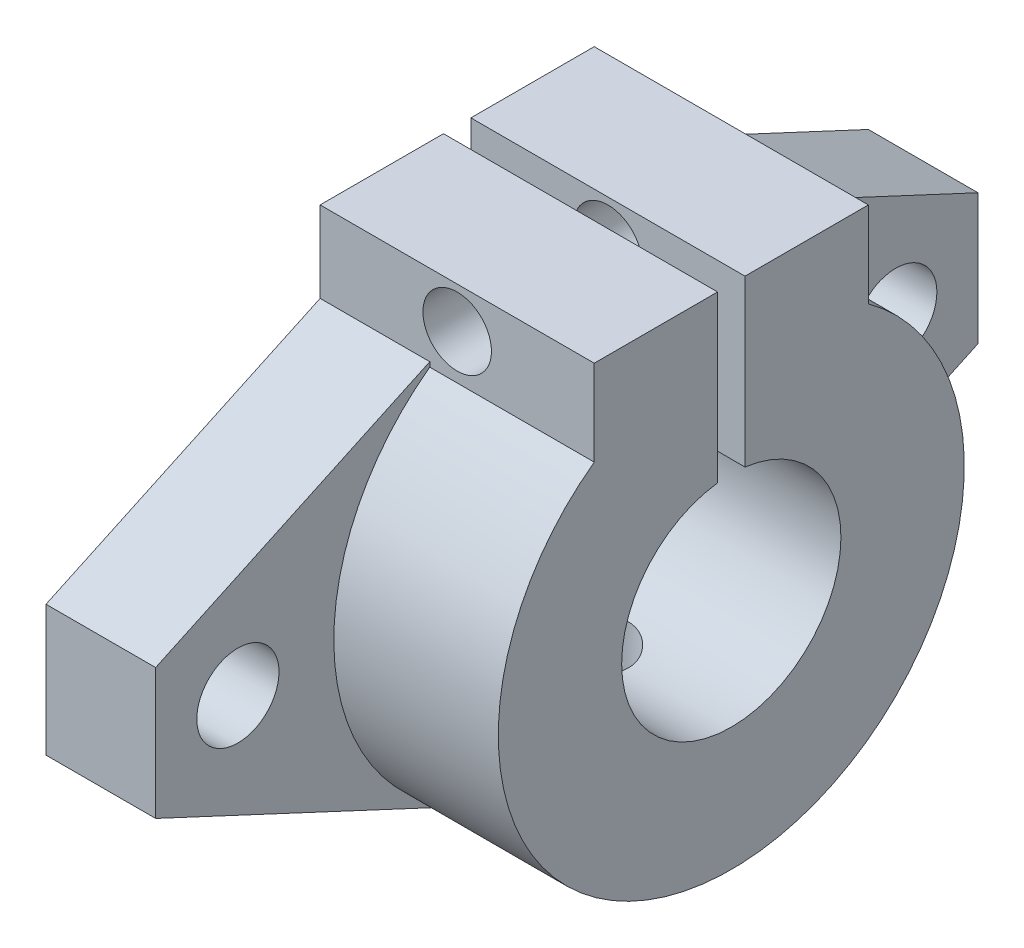
ISO-10303-21;
HEADER;
FILE_DESCRIPTION(('STEP AP214'),'2;1');
FILE_NAME('part.step','',(''),(''),'','','');
FILE_SCHEMA(('AUTOMOTIVE_DESIGN { 1 0 10303 214 1 1 1 1 }'));
ENDSEC;
DATA;
#1=APPLICATION_CONTEXT('core data for automotive mechanical design processes');
#2=APPLICATION_PROTOCOL_DEFINITION('international standard','automotive_design',2000,#1);
#3=PRODUCT_CONTEXT('',#1,'mechanical');
#4=PRODUCT('Part','Part','',(#3));
#5=PRODUCT_RELATED_PRODUCT_CATEGORY('part','',(#4));
#6=PRODUCT_DEFINITION_FORMATION('','',#4);
#7=PRODUCT_DEFINITION_CONTEXT('part definition',#1,'design');
#8=PRODUCT_DEFINITION('design','',#6,#7);
#9=PRODUCT_DEFINITION_SHAPE('','',#8);
#10=(LENGTH_UNIT() NAMED_UNIT(*) SI_UNIT(.MILLI.,.METRE.));
#11=(NAMED_UNIT(*) PLANE_ANGLE_UNIT() SI_UNIT($,.RADIAN.));
#12=(NAMED_UNIT(*) SI_UNIT($,.STERADIAN.) SOLID_ANGLE_UNIT());
#13=UNCERTAINTY_MEASURE_WITH_UNIT(LENGTH_MEASURE(1.E-05),#10,'distance_accuracy_value','');
#14=(GEOMETRIC_REPRESENTATION_CONTEXT(3) GLOBAL_UNCERTAINTY_ASSIGNED_CONTEXT((#13)) GLOBAL_UNIT_ASSIGNED_CONTEXT((#10,
#11,#12)) REPRESENTATION_CONTEXT('',''));
#15=CARTESIAN_POINT('',(0.,0.,0.));
#16=DIRECTION('',(0.,0.,1.));
#17=DIRECTION('',(1.,0.,0.));
#18=AXIS2_PLACEMENT_3D('',#15,#16,#17);
#19=CARTESIAN_POINT('',(0.,20.,0.));
#20=DIRECTION('',(0.,-1.,0.));
#21=DIRECTION('',(0.,0.,-1.));
#22=AXIS2_PLACEMENT_3D('',#19,#20,#21);
#23=PLANE('',#22);
#24=DIRECTION('',(0.,0.,-1.));
#25=VECTOR('',#24,1.);
#26=CARTESIAN_POINT('',(20.,20.,10.));
#27=LINE('',#26,#25);
#28=CARTESIAN_POINT('',(20.,20.,10.));
#29=VERTEX_POINT('',#28);
#30=CARTESIAN_POINT('',(20.,20.,1.));
#31=VERTEX_POINT('',#30);
#32=EDGE_CURVE('E306',#29,#31,#27,.T.);
#33=ORIENTED_EDGE('',*,*,#32,.T.);
#34=DIRECTION('',(1.,0.,0.));
#35=VECTOR('',#34,1.);
#36=CARTESIAN_POINT('',(0.,20.,1.));
#37=LINE('',#36,#35);
#38=CARTESIAN_POINT('',(0.,20.,1.));
#39=VERTEX_POINT('',#38);
#40=EDGE_CURVE('E160',#39,#31,#37,.T.);
#41=ORIENTED_EDGE('',*,*,#40,.F.);
#42=DIRECTION('',(0.,0.,-1.));
#43=VECTOR('',#42,1.);
#44=CARTESIAN_POINT('',(0.,20.,10.));
#45=LINE('',#44,#43);
#46=CARTESIAN_POINT('',(0.,20.,10.));
#47=VERTEX_POINT('',#46);
#48=EDGE_CURVE('E178',#47,#39,#45,.T.);
#49=ORIENTED_EDGE('',*,*,#48,.F.);
#50=DIRECTION('',(1.,0.,0.));
#51=VECTOR('',#50,1.);
#52=CARTESIAN_POINT('',(0.,20.,10.));
#53=LINE('',#52,#51);
#54=EDGE_CURVE('E185',#47,#29,#53,.T.);
#55=ORIENTED_EDGE('',*,*,#54,.T.);
#56=EDGE_LOOP('',(#33,#41,#49,#55));
#57=FACE_BOUND('',#56,.T.);
#58=ADVANCED_FACE('F36',(#57),#23,.F.);
#59=CARTESIAN_POINT('',(20.,0.,0.));
#60=DIRECTION('',(-1.,0.,0.));
#61=DIRECTION('',(0.,0.,1.));
#62=AXIS2_PLACEMENT_3D('',#59,#60,#61);
#63=CYLINDRICAL_SURFACE('',#62,17.);
#64=CARTESIAN_POINT('',(7.5,-17.,0.));
#65=CARTESIAN_POINT('',(7.5000057818919,-16.999997793131,0.139618263933644));
#66=CARTESIAN_POINT('',(7.51173543487887,-16.9982619631343,0.279318334742722));
#67=CARTESIAN_POINT('',(7.55833351140894,-16.9915044414465,0.554815864347194));
#68=CARTESIAN_POINT('',(7.5932246719528,-16.9864795210156,0.690609351356019));
#69=CARTESIAN_POINT('',(7.68508252661281,-16.9737086836159,0.954266664820791));
#70=CARTESIAN_POINT('',(7.74203276548722,-16.9659647952965,1.08213631987448));
#71=CARTESIAN_POINT('',(7.87635246620653,-16.9486124241397,1.3264840365203));
#72=CARTESIAN_POINT('',(7.95371900828681,-16.9390042079744,1.44296372374599));
#73=CARTESIAN_POINT('',(8.12729534764653,-16.9189113868221,1.66212119979329));
#74=CARTESIAN_POINT('',(8.22362834272149,-16.9084213236713,1.76470092382526));
#75=CARTESIAN_POINT('',(8.43213798364859,-16.887789985922,1.95230070871523));
#76=CARTESIAN_POINT('',(8.54431552629467,-16.8776487311065,2.03731977497712));
#77=CARTESIAN_POINT('',(8.78198626363384,-16.8588102121396,2.18776463859896));
#78=CARTESIAN_POINT('',(8.90753989572348,-16.8501200004422,2.25309591742832));
#79=CARTESIAN_POINT('',(9.16798702676943,-16.8352417558288,2.36170671911329));
#80=CARTESIAN_POINT('',(9.30288003618359,-16.8290535918791,2.40498739680279));
#81=CARTESIAN_POINT('',(9.57714699371305,-16.819933589302,2.46796464304165));
#82=CARTESIAN_POINT('',(9.71648166832152,-16.8169786171038,2.4878288374678));
#83=CARTESIAN_POINT('',(9.99653561388198,-16.8145892786749,2.50392846030982));
#84=CARTESIAN_POINT('',(10.1372548079492,-16.8151547180392,2.50016519348747));
#85=CARTESIAN_POINT('',(10.4149011948491,-16.8197211578168,2.46925378270774));
#86=CARTESIAN_POINT('',(10.5518496591263,-16.8236947679923,2.44229207080977));
#87=CARTESIAN_POINT('',(10.8192574442999,-16.8345870467401,2.36604083270518));
#88=CARTESIAN_POINT('',(10.949716588053,-16.8415057956586,2.31675069735604));
#89=CARTESIAN_POINT('',(11.2010112183851,-16.857539142223,2.19704705914093));
#90=CARTESIAN_POINT('',(11.321808420458,-16.8666619500121,2.12655433007144));
#91=CARTESIAN_POINT('',(11.5499300408962,-16.8860695216999,1.96650298810832));
#92=CARTESIAN_POINT('',(11.6572536081856,-16.8963543589216,1.87694317178514));
#93=CARTESIAN_POINT('',(11.8564621362888,-16.9170482652418,1.6802753243751));
#94=CARTESIAN_POINT('',(11.9481888499099,-16.9274575785055,1.57300695254414));
#95=CARTESIAN_POINT('',(12.112361690249,-16.9471357134677,1.34451413749425));
#96=CARTESIAN_POINT('',(12.1848077383585,-16.9564045305161,1.22328963737823));
#97=CARTESIAN_POINT('',(12.3083698864632,-16.9727664753804,0.9701904368467));
#98=CARTESIAN_POINT('',(12.3594740689283,-16.9798583870044,0.838309834869856));
#99=CARTESIAN_POINT('',(12.4387657716015,-16.991057196357,0.567710944898676));
#100=CARTESIAN_POINT('',(12.4669547803696,-16.9951642879764,0.428993101669628));
#101=CARTESIAN_POINT('',(12.4994062031872,-16.9999050818336,0.15002351928223));
#102=CARTESIAN_POINT('',(12.5038862295277,-17.0005703732726,0.00979761097236577));
#103=CARTESIAN_POINT('',(12.4893697048661,-16.9984385067869,-0.269403415413675));
#104=CARTESIAN_POINT('',(12.4703738516153,-16.9956414517703,-0.408378570541142));
#105=CARTESIAN_POINT('',(12.4096257278691,-16.9869187192332,-0.680476104424863));
#106=CARTESIAN_POINT('',(12.3679791908908,-16.9810075822558,-0.813622595189719));
#107=CARTESIAN_POINT('',(12.2632231929786,-16.9667174597167,-1.07104301967474));
#108=CARTESIAN_POINT('',(12.2001127581768,-16.9583383621802,-1.19531655049811));
#109=CARTESIAN_POINT('',(12.05370788706,-16.9399652839742,-1.43242218615397));
#110=CARTESIAN_POINT('',(11.9702750642557,-16.9299603948874,-1.54516798121673));
#111=CARTESIAN_POINT('',(11.7857868287116,-16.9094840590999,-1.75513489222198));
#112=CARTESIAN_POINT('',(11.6847304336169,-16.8990125864157,-1.85235514217674));
#113=CARTESIAN_POINT('',(11.4668961579167,-16.8786834541762,-2.02930056628108));
#114=CARTESIAN_POINT('',(11.3499993493592,-16.8688313544641,-2.10888006584901));
#115=CARTESIAN_POINT('',(11.1043698926707,-16.8509540599789,-2.24727323997786));
#116=CARTESIAN_POINT('',(10.9756375545786,-16.8429288173692,-2.3060874583028));
#117=CARTESIAN_POINT('',(10.7104301688104,-16.8296538581595,-2.40105348668989));
#118=CARTESIAN_POINT('',(10.5739833136259,-16.8243946779348,-2.43728264767767));
#119=CARTESIAN_POINT('',(10.2968588468238,-16.8172219020188,-2.48629673443479));
#120=CARTESIAN_POINT('',(10.1561815156867,-16.815308085025,-2.49908321098619));
#121=CARTESIAN_POINT('',(9.87604101010156,-16.8150507670265,-2.50081314025998));
#122=CARTESIAN_POINT('',(9.7365792272196,-16.8166729719777,-2.48998561242761));
#123=CARTESIAN_POINT('',(9.46148268732387,-16.8232304869987,-2.4452849279886));
#124=CARTESIAN_POINT('',(9.32584792511209,-16.8281657925681,-2.41141180268506));
#125=CARTESIAN_POINT('',(9.06231488044494,-16.8407816094163,-2.32166128628094));
#126=CARTESIAN_POINT('',(8.93441126071403,-16.8484602009356,-2.26579928028701));
#127=CARTESIAN_POINT('',(8.68975477312122,-16.8656998369544,-2.13367943489691));
#128=CARTESIAN_POINT('',(8.57300225333166,-16.8752609401864,-2.05742095912403));
#129=CARTESIAN_POINT('',(8.35279758221689,-16.8952988011725,-1.88583847980749));
#130=CARTESIAN_POINT('',(8.24947840565394,-16.9057832085905,-1.79034469442663));
#131=CARTESIAN_POINT('',(8.06024921946042,-16.92642201351,-1.58336095356046));
#132=CARTESIAN_POINT('',(7.97434326811475,-16.9365763336202,-1.47186727949618));
#133=CARTESIAN_POINT('',(7.82197580820316,-16.9554718925697,-1.23535773881122));
#134=CARTESIAN_POINT('',(7.75561935846873,-16.9642053874589,-1.11027358494527));
#135=CARTESIAN_POINT('',(7.64495569968175,-16.9791991247469,-0.850667584310129));
#136=CARTESIAN_POINT('',(7.60062551088327,-16.9854619433621,-0.716155741284794));
#137=CARTESIAN_POINT('',(7.54540047060192,-16.9933688461727,-0.484190218187674));
#138=CARTESIAN_POINT('',(7.52840111324459,-16.9958428419025,-0.38817262422865));
#139=CARTESIAN_POINT('',(7.5056989270881,-16.9991591791261,-0.194783283695076));
#140=CARTESIAN_POINT('',(7.49999596597856,-17.0000015397308,-0.0974115529944622));
#141=CARTESIAN_POINT('',(7.5,-17.,0.));
#142=B_SPLINE_CURVE_WITH_KNOTS('',3,(#64,#65,#66,#67,#68,#69,#70,#71,#72,#73,#74,#75,#76,#77,
#78,#79,#80,#81,#82,#83,#84,#85,#86,#87,#88,#89,#90,#91,#92,#93,#94,#95,#96,#97,#98,#99,#100,
#101,#102,#103,#104,#105,#106,#107,#108,#109,#110,#111,#112,#113,#114,#115,#116,#117,#118,#119,
#120,#121,#122,#123,#124,#125,#126,#127,#128,#129,#130,#131,#132,#133,#134,#135,#136,#137,#138,
#139,#140,#141),.UNSPECIFIED.,.T.,.F.,(4,2,2,2,2,2,2,2,2,2,2,2,2,2,2,2,2,2,2,2,2,2,2,2,2,2,2,2,
2,2,2,2,2,2,2,2,2,2,4),(0.,0.418498857511903,0.83740915233018,1.25600755579684,1.67454612732146,
2.09589880308585,2.51727533677714,2.94064374704006,3.36398998237661,3.78428694551126,
4.20456069910212,4.62148817747431,5.03842703074502,5.45694360373011,5.87548659945092,
6.29805109091574,6.72061730517519,7.14341917050654,7.56619356861207,7.98508072630458,
8.40395543411031,8.82089140788565,9.23784630155638,9.65772400348285,10.0776251172785,
10.5008742387869,10.9241122761825,11.3458926970847,11.7676452153327,12.1853255880243,
12.6030053933771,13.0203934758991,13.4377945825891,13.8590554809119,14.2804144447029,
14.7039981269519,15.1271389563846,15.4191287002785,15.7111150241882),.UNSPECIFIED.);
#143=CARTESIAN_POINT('',(7.5,-17.,0.));
#144=VERTEX_POINT('',#143);
#145=EDGE_CURVE('E286',#144,#144,#142,.T.);
#146=ORIENTED_EDGE('',*,*,#145,.T.);
#147=EDGE_LOOP('',(#146));
#148=FACE_BOUND('',#147,.T.);
#149=DIRECTION('',(-1.,0.,0.));
#150=VECTOR('',#149,1.);
#151=CARTESIAN_POINT('',(20.,13.7477270848675,-10.));
#152=LINE('',#151,#150);
#153=CARTESIAN_POINT('',(8.,13.7477270848675,-10.));
#154=VERTEX_POINT('',#153);
#155=CARTESIAN_POINT('',(20.,13.7477270848675,-10.));
#156=VERTEX_POINT('',#155);
#157=EDGE_CURVE('E201',#154,#156,#152,.F.);
#158=ORIENTED_EDGE('',*,*,#157,.T.);
#159=CARTESIAN_POINT('',(20.,0.,0.));
#160=DIRECTION('',(1.,0.,0.));
#161=DIRECTION('',(0.,0.,-1.));
#162=AXIS2_PLACEMENT_3D('',#159,#160,#161);
#163=CIRCLE('',#162,17.);
#164=CARTESIAN_POINT('',(20.,13.7477270848763,10.));
#165=VERTEX_POINT('',#164);
#166=EDGE_CURVE('E245',#165,#156,#163,.T.);
#167=ORIENTED_EDGE('',*,*,#166,.F.);
#168=DIRECTION('',(-1.,0.,0.));
#169=VECTOR('',#168,1.);
#170=CARTESIAN_POINT('',(20.,13.7477270848675,10.));
#171=LINE('',#170,#169);
#172=CARTESIAN_POINT('',(8.,13.7477270848675,10.));
#173=VERTEX_POINT('',#172);
#174=EDGE_CURVE('E196',#173,#165,#171,.F.);
#175=ORIENTED_EDGE('',*,*,#174,.F.);
#176=CARTESIAN_POINT('',(8.,0.,0.));
#177=DIRECTION('',(1.,0.,0.));
#178=DIRECTION('',(0.,0.,-1.));
#179=AXIS2_PLACEMENT_3D('',#176,#177,#178);
#180=CIRCLE('',#179,17.);
#181=CARTESIAN_POINT('',(8.,-15.4072323796231,7.18451044959185));
#182=VERTEX_POINT('',#181);
#183=EDGE_CURVE('E255',#173,#182,#180,.T.);
#184=ORIENTED_EDGE('',*,*,#183,.T.);
#185=DIRECTION('',(-1.,0.,0.));
#186=VECTOR('',#185,1.);
#187=CARTESIAN_POINT('',(8.,-15.4072323796231,7.18451044959185));
#188=LINE('',#187,#186);
#189=CARTESIAN_POINT('',(0.,-15.4072323796231,7.18451044959185));
#190=VERTEX_POINT('',#189);
#191=EDGE_CURVE('E265',#182,#190,#188,.T.);
#192=ORIENTED_EDGE('',*,*,#191,.T.);
#193=CARTESIAN_POINT('',(0.,0.,0.));
#194=DIRECTION('',(1.,0.,0.));
#195=DIRECTION('',(0.,0.,-1.));
#196=AXIS2_PLACEMENT_3D('',#193,#194,#195);
#197=CIRCLE('',#196,17.);
#198=CARTESIAN_POINT('',(0.,-15.4072323796231,-7.18451044959186));
#199=VERTEX_POINT('',#198);
#200=EDGE_CURVE('E246',#190,#199,#197,.T.);
#201=ORIENTED_EDGE('',*,*,#200,.T.);
#202=DIRECTION('',(-1.,0.,0.));
#203=VECTOR('',#202,1.);
#204=CARTESIAN_POINT('',(8.,-15.4072323796231,-7.18451044959186));
#205=LINE('',#204,#203);
#206=CARTESIAN_POINT('',(8.,-15.4072323796231,-7.18451044959186));
#207=VERTEX_POINT('',#206);
#208=EDGE_CURVE('E239',#207,#199,#205,.T.);
#209=ORIENTED_EDGE('',*,*,#208,.F.);
#210=CARTESIAN_POINT('',(8.,0.,0.));
#211=DIRECTION('',(1.,0.,0.));
#212=DIRECTION('',(0.,0.,-1.));
#213=AXIS2_PLACEMENT_3D('',#210,#211,#212);
#214=CIRCLE('',#213,17.);
#215=EDGE_CURVE('E211',#207,#154,#214,.T.);
#216=ORIENTED_EDGE('',*,*,#215,.T.);
#217=EDGE_LOOP('',(#158,#167,#175,#184,#192,#201,#209,#216));
#218=FACE_BOUND('',#217,.T.);
#219=ADVANCED_FACE('F334',(#148,#218),#63,.T.);
#220=CARTESIAN_POINT('',(8.,15.4072323796231,-7.18451044959185));
#221=DIRECTION('',(0.,0.906307787036651,-0.422618261740697));
#222=DIRECTION('',(0.,0.422618261740697,0.906307787036651));
#223=AXIS2_PLACEMENT_3D('',#220,#221,#222);
#224=PLANE('',#223);
#225=DIRECTION('',(0.,-0.422618261740697,-0.906307787036651));
#226=VECTOR('',#225,1.);
#227=CARTESIAN_POINT('',(0.,15.4072323796231,-7.18451044959185));
#228=LINE('',#227,#226);
#229=CARTESIAN_POINT('',(0.,14.0943480407714,-10.));
#230=VERTEX_POINT('',#229);
#231=CARTESIAN_POINT('',(0.,4.76819487771248,-30.));
#232=VERTEX_POINT('',#231);
#233=EDGE_CURVE('E231',#230,#232,#228,.T.);
#234=ORIENTED_EDGE('',*,*,#233,.F.);
#235=DIRECTION('',(-1.,0.,0.));
#236=VECTOR('',#235,1.);
#237=CARTESIAN_POINT('',(0.,14.0943480407714,-10.));
#238=LINE('',#237,#236);
#239=CARTESIAN_POINT('',(8.,14.0943480408214,-9.99999999999759));
#240=VERTEX_POINT('',#239);
#241=EDGE_CURVE('E207',#240,#230,#238,.T.);
#242=ORIENTED_EDGE('',*,*,#241,.F.);
#243=DIRECTION('',(0.,-0.422618261740697,-0.906307787036651));
#244=VECTOR('',#243,1.);
#245=CARTESIAN_POINT('',(8.,15.4072323796231,-7.18451044959185));
#246=LINE('',#245,#244);
#247=CARTESIAN_POINT('',(8.,4.76819487771248,-30.));
#248=VERTEX_POINT('',#247);
#249=EDGE_CURVE('E220',#240,#248,#246,.T.);
#250=ORIENTED_EDGE('',*,*,#249,.T.);
#251=DIRECTION('',(-1.,0.,0.));
#252=VECTOR('',#251,1.);
#253=CARTESIAN_POINT('',(8.,4.76819487771248,-30.));
#254=LINE('',#253,#252);
#255=EDGE_CURVE('E225',#248,#232,#254,.T.);
#256=ORIENTED_EDGE('',*,*,#255,.T.);
#257=EDGE_LOOP('',(#234,#242,#250,#256));
#258=FACE_BOUND('',#257,.T.);
#259=ADVANCED_FACE('F320',(#258),#224,.T.);
#260=CARTESIAN_POINT('',(8.,0.,0.));
#261=DIRECTION('',(1.,0.,0.));
#262=DIRECTION('',(0.,0.,-1.));
#263=AXIS2_PLACEMENT_3D('',#260,#261,#262);
#264=PLANE('',#263);
#265=CARTESIAN_POINT('',(8.,0.,-24.));
#266=DIRECTION('',(1.,0.,0.));
#267=DIRECTION('',(0.,0.,-1.));
#268=AXIS2_PLACEMENT_3D('',#265,#266,#267);
#269=CIRCLE('',#268,3.);
#270=CARTESIAN_POINT('',(8.,0.,-27.));
#271=VERTEX_POINT('',#270);
#272=EDGE_CURVE('E222',#271,#271,#269,.F.);
#273=ORIENTED_EDGE('',*,*,#272,.T.);
#274=EDGE_LOOP('',(#273));
#275=FACE_BOUND('',#274,.T.);
#276=ORIENTED_EDGE('',*,*,#249,.F.);
#277=DIRECTION('',(0.,1.,0.));
#278=VECTOR('',#277,1.);
#279=CARTESIAN_POINT('',(8.,-500000.,-10.));
#280=LINE('',#279,#278);
#281=EDGE_CURVE('E205',#154,#240,#280,.T.);
#282=ORIENTED_EDGE('',*,*,#281,.F.);
#283=ORIENTED_EDGE('',*,*,#215,.F.);
#284=DIRECTION('',(0.,0.422618261740697,-0.906307787036651));
#285=VECTOR('',#284,1.);
#286=CARTESIAN_POINT('',(8.,-15.4072323796231,-7.18451044959185));
#287=LINE('',#286,#285);
#288=CARTESIAN_POINT('',(8.,-4.76819487771248,-30.));
#289=VERTEX_POINT('',#288);
#290=EDGE_CURVE('E214',#207,#289,#287,.T.);
#291=ORIENTED_EDGE('',*,*,#290,.T.);
#292=DIRECTION('',(0.,-1.,0.));
#293=VECTOR('',#292,1.);
#294=CARTESIAN_POINT('',(8.,0.,-30.));
#295=LINE('',#294,#293);
#296=EDGE_CURVE('E217',#248,#289,#295,.T.);
#297=ORIENTED_EDGE('',*,*,#296,.F.);
#298=EDGE_LOOP('',(#276,#282,#283,#291,#297));
#299=FACE_BOUND('',#298,.T.);
#300=ADVANCED_FACE('F429',(#275,#299),#264,.T.);
#301=CARTESIAN_POINT('',(8.,15.4072323796231,7.18451044959185));
#302=DIRECTION('',(0.,-0.906307787036651,-0.422618261740697));
#303=DIRECTION('',(0.,0.422618261740697,-0.906307787036651));
#304=AXIS2_PLACEMENT_3D('',#301,#302,#303);
#305=PLANE('',#304);
#306=DIRECTION('',(0.,-0.422618261740697,0.906307787036651));
#307=VECTOR('',#306,1.);
#308=CARTESIAN_POINT('',(8.,15.4072323796231,7.18451044959185));
#309=LINE('',#308,#307);
#310=CARTESIAN_POINT('',(8.,14.0943480408214,9.99999999999759));
#311=VERTEX_POINT('',#310);
#312=CARTESIAN_POINT('',(8.,4.76819487771247,30.));
#313=VERTEX_POINT('',#312);
#314=EDGE_CURVE('E258',#311,#313,#309,.T.);
#315=ORIENTED_EDGE('',*,*,#314,.F.);
#316=DIRECTION('',(1.,0.,0.));
#317=VECTOR('',#316,1.);
#318=CARTESIAN_POINT('',(0.,14.0943480407714,10.));
#319=LINE('',#318,#317);
#320=CARTESIAN_POINT('',(0.,14.0943480408282,10.));
#321=VERTEX_POINT('',#320);
#322=EDGE_CURVE('E203',#321,#311,#319,.T.);
#323=ORIENTED_EDGE('',*,*,#322,.F.);
#324=DIRECTION('',(0.,-0.422618261740697,0.906307787036651));
#325=VECTOR('',#324,1.);
#326=CARTESIAN_POINT('',(0.,15.4072323796231,7.18451044959185));
#327=LINE('',#326,#325);
#328=CARTESIAN_POINT('',(0.,4.76819487771247,30.));
#329=VERTEX_POINT('',#328);
#330=EDGE_CURVE('E268',#321,#329,#327,.T.);
#331=ORIENTED_EDGE('',*,*,#330,.T.);
#332=DIRECTION('',(-1.,0.,0.));
#333=VECTOR('',#332,1.);
#334=CARTESIAN_POINT('',(8.,4.76819487771247,30.));
#335=LINE('',#334,#333);
#336=EDGE_CURVE('E11',#313,#329,#335,.T.);
#337=ORIENTED_EDGE('',*,*,#336,.F.);
#338=EDGE_LOOP('',(#315,#323,#331,#337));
#339=FACE_BOUND('',#338,.T.);
#340=ADVANCED_FACE('F351',(#339),#305,.F.);
#341=CARTESIAN_POINT('',(8.,0.,30.));
#342=DIRECTION('',(0.,0.,-1.));
#343=DIRECTION('',(-1.,0.,0.));
#344=AXIS2_PLACEMENT_3D('',#341,#342,#343);
#345=PLANE('',#344);
#346=DIRECTION('',(0.,-1.,0.));
#347=VECTOR('',#346,1.);
#348=CARTESIAN_POINT('',(0.,0.,30.));
#349=LINE('',#348,#347);
#350=CARTESIAN_POINT('',(0.,-4.76819487771247,30.));
#351=VERTEX_POINT('',#350);
#352=EDGE_CURVE('E270',#329,#351,#349,.T.);
#353=ORIENTED_EDGE('',*,*,#352,.T.);
#354=DIRECTION('',(-1.,0.,0.));
#355=VECTOR('',#354,1.);
#356=CARTESIAN_POINT('',(8.,-4.76819487771247,30.));
#357=LINE('',#356,#355);
#358=CARTESIAN_POINT('',(8.,-4.76819487771247,30.));
#359=VERTEX_POINT('',#358);
#360=EDGE_CURVE('E49',#359,#351,#357,.T.);
#361=ORIENTED_EDGE('',*,*,#360,.F.);
#362=DIRECTION('',(0.,-1.,0.));
#363=VECTOR('',#362,1.);
#364=CARTESIAN_POINT('',(8.,0.,30.));
#365=LINE('',#364,#363);
#366=EDGE_CURVE('E260',#313,#359,#365,.T.);
#367=ORIENTED_EDGE('',*,*,#366,.F.);
#368=ORIENTED_EDGE('',*,*,#336,.T.);
#369=EDGE_LOOP('',(#353,#361,#367,#368));
#370=FACE_BOUND('',#369,.T.);
#371=ADVANCED_FACE('F348',(#370),#345,.F.);
#372=CARTESIAN_POINT('',(8.,0.,24.));
#373=DIRECTION('',(-1.,0.,0.));
#374=DIRECTION('',(0.,0.,1.));
#375=AXIS2_PLACEMENT_3D('',#372,#373,#374);
#376=CYLINDRICAL_SURFACE('',#375,3.);
#377=CARTESIAN_POINT('',(8.,0.,24.));
#378=DIRECTION('',(1.,0.,0.));
#379=DIRECTION('',(0.,0.,-1.));
#380=AXIS2_PLACEMENT_3D('',#377,#378,#379);
#381=CIRCLE('',#380,3.);
#382=CARTESIAN_POINT('',(8.,0.,21.));
#383=VERTEX_POINT('',#382);
#384=EDGE_CURVE('E252',#383,#383,#381,.T.);
#385=ORIENTED_EDGE('',*,*,#384,.T.);
#386=EDGE_LOOP('',(#385));
#387=FACE_BOUND('',#386,.T.);
#388=CARTESIAN_POINT('',(0.,0.,24.));
#389=DIRECTION('',(1.,0.,0.));
#390=DIRECTION('',(0.,0.,-1.));
#391=AXIS2_PLACEMENT_3D('',#388,#389,#390);
#392=CIRCLE('',#391,3.);
#393=CARTESIAN_POINT('',(0.,0.,21.));
#394=VERTEX_POINT('',#393);
#395=EDGE_CURVE('E249',#394,#394,#392,.T.);
#396=ORIENTED_EDGE('',*,*,#395,.F.);
#397=EDGE_LOOP('',(#396));
#398=FACE_BOUND('',#397,.T.);
#399=ADVANCED_FACE('F38',(#387,#398),#376,.F.);
#400=CARTESIAN_POINT('',(8.,-15.4072323796231,7.18451044959185));
#401=DIRECTION('',(0.,-0.906307787036651,0.422618261740697));
#402=DIRECTION('',(0.,-0.422618261740697,-0.906307787036651));
#403=AXIS2_PLACEMENT_3D('',#400,#401,#402);
#404=PLANE('',#403);
#405=DIRECTION('',(0.,0.422618261740697,0.906307787036651));
#406=VECTOR('',#405,1.);
#407=CARTESIAN_POINT('',(0.,-15.4072323796231,7.18451044959185));
#408=LINE('',#407,#406);
#409=EDGE_CURVE('E256',#190,#351,#408,.T.);
#410=ORIENTED_EDGE('',*,*,#409,.F.);
#411=ORIENTED_EDGE('',*,*,#191,.F.);
#412=DIRECTION('',(0.,0.422618261740697,0.906307787036651));
#413=VECTOR('',#412,1.);
#414=CARTESIAN_POINT('',(8.,-15.4072323796231,7.18451044959185));
#415=LINE('',#414,#413);
#416=EDGE_CURVE('E262',#182,#359,#415,.T.);
#417=ORIENTED_EDGE('',*,*,#416,.T.);
#418=ORIENTED_EDGE('',*,*,#360,.T.);
#419=EDGE_LOOP('',(#410,#411,#417,#418));
#420=FACE_BOUND('',#419,.T.);
#421=ADVANCED_FACE('F341',(#420),#404,.T.);
#422=CARTESIAN_POINT('',(8.,0.,0.));
#423=DIRECTION('',(1.,0.,0.));
#424=DIRECTION('',(0.,0.,-1.));
#425=AXIS2_PLACEMENT_3D('',#422,#423,#424);
#426=PLANE('',#425);
#427=DIRECTION('',(0.,1.,0.));
#428=VECTOR('',#427,1.);
#429=CARTESIAN_POINT('',(8.,-500000.,10.));
#430=LINE('',#429,#428);
#431=EDGE_CURVE('E197',#173,#311,#430,.T.);
#432=ORIENTED_EDGE('',*,*,#431,.T.);
#433=ORIENTED_EDGE('',*,*,#314,.T.);
#434=ORIENTED_EDGE('',*,*,#366,.T.);
#435=ORIENTED_EDGE('',*,*,#416,.F.);
#436=ORIENTED_EDGE('',*,*,#183,.F.);
#437=EDGE_LOOP('',(#432,#433,#434,#435,#436));
#438=FACE_BOUND('',#437,.T.);
#439=ORIENTED_EDGE('',*,*,#384,.F.);
#440=EDGE_LOOP('',(#439));
#441=FACE_BOUND('',#440,.T.);
#442=ADVANCED_FACE('F357',(#438,#441),#426,.T.);
#443=CARTESIAN_POINT('',(0.,0.,0.));
#444=DIRECTION('',(1.,0.,0.));
#445=DIRECTION('',(0.,0.,-1.));
#446=AXIS2_PLACEMENT_3D('',#443,#444,#445);
#447=PLANE('',#446);
#448=ORIENTED_EDGE('',*,*,#395,.T.);
#449=EDGE_LOOP('',(#448));
#450=FACE_BOUND('',#449,.T.);
#451=ORIENTED_EDGE('',*,*,#48,.T.);
#452=DIRECTION('',(0.,1.,0.));
#453=VECTOR('',#452,1.);
#454=CARTESIAN_POINT('',(0.,0.,1.));
#455=LINE('',#454,#453);
#456=CARTESIAN_POINT('',(0.,7.93725393319377,1.));
#457=VERTEX_POINT('',#456);
#458=EDGE_CURVE('E65',#457,#39,#455,.T.);
#459=ORIENTED_EDGE('',*,*,#458,.F.);
#460=CARTESIAN_POINT('',(0.,0.,0.));
#461=DIRECTION('',(1.,0.,0.));
#462=DIRECTION('',(0.,0.,-1.));
#463=AXIS2_PLACEMENT_3D('',#460,#461,#462);
#464=CIRCLE('',#463,8.);
#465=CARTESIAN_POINT('',(0.,7.93725393319377,-1.));
#466=VERTEX_POINT('',#465);
#467=EDGE_CURVE('E172',#457,#466,#464,.T.);
#468=ORIENTED_EDGE('',*,*,#467,.T.);
#469=DIRECTION('',(0.,1.,0.));
#470=VECTOR('',#469,1.);
#471=CARTESIAN_POINT('',(0.,0.,-1.));
#472=LINE('',#471,#470);
#473=CARTESIAN_POINT('',(0.,20.,-1.));
#474=VERTEX_POINT('',#473);
#475=EDGE_CURVE('E155',#466,#474,#472,.T.);
#476=ORIENTED_EDGE('',*,*,#475,.T.);
#477=CARTESIAN_POINT('',(0.,20.,-10.));
#478=VERTEX_POINT('',#477);
#479=EDGE_CURVE('E169',#474,#478,#45,.T.);
#480=ORIENTED_EDGE('',*,*,#479,.T.);
#481=DIRECTION('',(0.,1.,0.));
#482=VECTOR('',#481,1.);
#483=CARTESIAN_POINT('',(0.,-500000.,-10.));
#484=LINE('',#483,#482);
#485=EDGE_CURVE('E194',#230,#478,#484,.T.);
#486=ORIENTED_EDGE('',*,*,#485,.F.);
#487=ORIENTED_EDGE('',*,*,#233,.T.);
#488=DIRECTION('',(0.,-1.,0.));
#489=VECTOR('',#488,1.);
#490=CARTESIAN_POINT('',(0.,0.,-30.));
#491=LINE('',#490,#489);
#492=CARTESIAN_POINT('',(0.,-4.76819487771248,-30.));
#493=VERTEX_POINT('',#492);
#494=EDGE_CURVE('E228',#232,#493,#491,.T.);
#495=ORIENTED_EDGE('',*,*,#494,.T.);
#496=DIRECTION('',(0.,0.422618261740697,-0.906307787036651));
#497=VECTOR('',#496,1.);
#498=CARTESIAN_POINT('',(0.,-15.4072323796231,-7.18451044959185));
#499=LINE('',#498,#497);
#500=EDGE_CURVE('E200',#199,#493,#499,.T.);
#501=ORIENTED_EDGE('',*,*,#500,.F.);
#502=ORIENTED_EDGE('',*,*,#200,.F.);
#503=ORIENTED_EDGE('',*,*,#409,.T.);
#504=ORIENTED_EDGE('',*,*,#352,.F.);
#505=ORIENTED_EDGE('',*,*,#330,.F.);
#506=DIRECTION('',(0.,1.,0.));
#507=VECTOR('',#506,1.);
#508=CARTESIAN_POINT('',(0.,-500000.,10.));
#509=LINE('',#508,#507);
#510=EDGE_CURVE('E187',#321,#47,#509,.T.);
#511=ORIENTED_EDGE('',*,*,#510,.T.);
#512=EDGE_LOOP('',(#451,#459,#468,#476,#480,#486,#487,#495,#501,#502,#503,#504,#505,#511));
#513=FACE_BOUND('',#512,.T.);
#514=CARTESIAN_POINT('',(0.,0.,-24.));
#515=DIRECTION('',(1.,0.,0.));
#516=DIRECTION('',(0.,0.,-1.));
#517=AXIS2_PLACEMENT_3D('',#514,#515,#516);
#518=CIRCLE('',#517,3.);
#519=CARTESIAN_POINT('',(0.,0.,-27.));
#520=VERTEX_POINT('',#519);
#521=EDGE_CURVE('E215',#520,#520,#518,.F.);
#522=ORIENTED_EDGE('',*,*,#521,.F.);
#523=EDGE_LOOP('',(#522));
#524=FACE_BOUND('',#523,.T.);
#525=ADVANCED_FACE('F166',(#450,#513,#524),#447,.F.);
#526=CARTESIAN_POINT('',(20.,0.,0.));
#527=DIRECTION('',(-1.,0.,0.));
#528=DIRECTION('',(0.,0.,1.));
#529=AXIS2_PLACEMENT_3D('',#526,#527,#528);
#530=CYLINDRICAL_SURFACE('',#529,8.);
#531=CARTESIAN_POINT('',(10.,-7.59934207678533,2.5));
#532=CARTESIAN_POINT('',(10.1366940722187,-7.59934291923872,2.49999907560094));
#533=CARTESIAN_POINT('',(10.2733975374064,-7.60307063010085,2.48875077582989));
#534=CARTESIAN_POINT('',(10.5427883217556,-7.61751277997754,2.44418350802654));
#535=CARTESIAN_POINT('',(10.6754745454643,-7.62822910706272,2.4108585756503));
#536=CARTESIAN_POINT('',(10.932889803864,-7.65531877671919,2.32339576447118));
#537=CARTESIAN_POINT('',(11.0576324662114,-7.67168210388633,2.26929471473354));
#538=CARTESIAN_POINT('',(11.296305391728,-7.70820812437377,2.14193828346314));
#539=CARTESIAN_POINT('',(11.4102337399202,-7.72837148871681,2.06867951811264));
#540=CARTESIAN_POINT('',(11.627957734987,-7.7710025533724,1.90239214124459));
#541=CARTESIAN_POINT('',(11.731327218872,-7.79352246769561,1.8088187994408));
#542=CARTESIAN_POINT('',(11.9211920264184,-7.83788491720671,1.60572409291099));
#543=CARTESIAN_POINT('',(12.0076849938897,-7.85972735745255,1.49620050503713));
#544=CARTESIAN_POINT('',(12.1632221260225,-7.90087106780156,1.26125182498672));
#545=CARTESIAN_POINT('',(12.2318274076629,-7.9201036912556,1.13552311304019));
#546=CARTESIAN_POINT('',(12.3467520997111,-7.95325103666038,0.873608465706807));
#547=CARTESIAN_POINT('',(12.3930767482992,-7.9671670083984,0.737424996974103));
#548=CARTESIAN_POINT('',(12.4607022561941,-7.98774351641724,0.462928713932196));
#549=CARTESIAN_POINT('',(12.4827314995757,-7.99461477968283,0.324811430936432));
#550=CARTESIAN_POINT('',(12.503448692875,-8.00107191752033,0.0466816279690388));
#551=CARTESIAN_POINT('',(12.5021419487176,-8.00065944820141,-0.0933304539461731));
#552=CARTESIAN_POINT('',(12.4767034168281,-7.99274232265063,-0.366148960709464));
#553=CARTESIAN_POINT('',(12.453361232974,-7.98548301944274,-0.499037268628066));
#554=CARTESIAN_POINT('',(12.385810019914,-7.9649896512175,-0.758906126695562));
#555=CARTESIAN_POINT('',(12.3415996298267,-7.95175519654419,-0.885886290962472));
#556=CARTESIAN_POINT('',(12.2330596218504,-7.92046919458913,-1.13215620630948));
#557=CARTESIAN_POINT('',(12.1684903828745,-7.90236067233341,-1.25133281124536));
#558=CARTESIAN_POINT('',(12.0212578005903,-7.86323445907697,-1.47740502230436));
#559=CARTESIAN_POINT('',(11.9385898817223,-7.84221603291309,-1.58429751241882));
#560=CARTESIAN_POINT('',(11.7534527303996,-7.79847341467064,-1.78747539690657));
#561=CARTESIAN_POINT('',(11.6503018623258,-7.77571463969686,-1.88313309818382));
#562=CARTESIAN_POINT('',(11.4292097963429,-7.73181230889308,-2.05597948519529));
#563=CARTESIAN_POINT('',(11.3112668588193,-7.71066894351396,-2.13316599552377));
#564=CARTESIAN_POINT('',(11.0621650623049,-7.6722169326579,-2.26760930038169));
#565=CARTESIAN_POINT('',(10.9308731820181,-7.65495380588194,-2.32463361399527));
#566=CARTESIAN_POINT('',(10.659881016316,-7.62675090557699,-2.41556691891091));
#567=CARTESIAN_POINT('',(10.5201837716112,-7.61580886035023,-2.44948421530003));
#568=CARTESIAN_POINT('',(10.2423600948457,-7.60199126814082,-2.4920297037281));
#569=CARTESIAN_POINT('',(10.1043960075297,-7.59880932787513,-2.50161908707794));
#570=CARTESIAN_POINT('',(9.82882051700972,-7.6000215491985,-2.49793488996242));
#571=CARTESIAN_POINT('',(9.69120906260067,-7.60441454014633,-2.48466484222813));
#572=CARTESIAN_POINT('',(9.42438340669515,-7.61997914967833,-2.43649747026382));
#573=CARTESIAN_POINT('',(9.2950414518516,-7.63095108204022,-2.40223662321101));
#574=CARTESIAN_POINT('',(9.04395641600833,-7.65822574662762,-2.31380747322029));
#575=CARTESIAN_POINT('',(8.92221457815774,-7.67452934824624,-2.25963592342302));
#576=CARTESIAN_POINT('',(8.68592178045638,-7.71121079306468,-2.13115021311757));
#577=CARTESIAN_POINT('',(8.57167716881442,-7.73169206979508,-2.05630294977117));
#578=CARTESIAN_POINT('',(8.3570193072762,-7.77420697945615,-1.8892128173596));
#579=CARTESIAN_POINT('',(8.25660966214933,-7.79624101471394,-1.79696542938156));
#580=CARTESIAN_POINT('',(8.06817926817436,-7.84048375125371,-1.59314589550721));
#581=CARTESIAN_POINT('',(7.98084442772027,-7.86266184571362,-1.48093129957704));
#582=CARTESIAN_POINT('',(7.82621791335749,-7.90378119687353,-1.24290309130279));
#583=CARTESIAN_POINT('',(7.75892532137793,-7.92272260181891,-1.11709010221724));
#584=CARTESIAN_POINT('',(7.64693887505664,-7.95512623857025,-0.856211046663663));
#585=CARTESIAN_POINT('',(7.60208142431264,-7.968627991224,-0.721220368567511));
#586=CARTESIAN_POINT('',(7.53585492282059,-7.98880485297152,-0.445114508112779));
#587=CARTESIAN_POINT('',(7.51447852183301,-7.99548209828555,-0.304001256680713));
#588=CARTESIAN_POINT('',(7.49641799650076,-8.00111606808923,-0.0259698732977977));
#589=CARTESIAN_POINT('',(7.49874309965848,-8.0003825881478,0.110878383893045));
#590=CARTESIAN_POINT('',(7.52562362209739,-7.99201956162097,0.382146443846496));
#591=CARTESIAN_POINT('',(7.5501775919839,-7.98439046465238,0.516566404359137));
#592=CARTESIAN_POINT('',(7.62018801844455,-7.96319141689591,0.777510236961582));
#593=CARTESIAN_POINT('',(7.66537921569074,-7.9496969592041,0.904111836898962));
#594=CARTESIAN_POINT('',(7.77514165441695,-7.918158911759,1.14799685100018));
#595=CARTESIAN_POINT('',(7.83971621994686,-7.90011454182716,1.26527866254896));
#596=CARTESIAN_POINT('',(7.98894551668888,-7.86059793766752,1.49152338993938));
#597=CARTESIAN_POINT('',(8.07420704492795,-7.83903019501924,1.60006921410622));
#598=CARTESIAN_POINT('',(8.26131977888693,-7.79517473094122,1.80164158279864));
#599=CARTESIAN_POINT('',(8.36317594827877,-7.77288679569653,1.89466346700832));
#600=CARTESIAN_POINT('',(8.5846314396822,-7.72923785154876,2.06565731822505));
#601=CARTESIAN_POINT('',(8.70470680623315,-7.70793201726912,2.14302855989422));
#602=CARTESIAN_POINT('',(8.95679624053828,-7.66960250559062,2.27640941497043));
#603=CARTESIAN_POINT('',(9.0888054529005,-7.65257709722773,2.33242766807092));
#604=CARTESIAN_POINT('',(9.34944523462934,-7.62613120880655,2.41742360871585));
#605=CARTESIAN_POINT('',(9.47740509490313,-7.61618630087498,2.44829879675747));
#606=CARTESIAN_POINT('',(9.73690766419298,-7.60279212964797,2.48958491632199));
#607=CARTESIAN_POINT('',(9.868449482403,-7.59934126603196,2.50000088961557));
#608=CARTESIAN_POINT('',(10.,-7.59934207678533,2.5));
#609=B_SPLINE_CURVE_WITH_KNOTS('',3,(#531,#532,#533,#534,#535,#536,#537,#538,#539,#540,#541,
#542,#543,#544,#545,#546,#547,#548,#549,#550,#551,#552,#553,#554,#555,#556,#557,#558,#559,#560,
#561,#562,#563,#564,#565,#566,#567,#568,#569,#570,#571,#572,#573,#574,#575,#576,#577,#578,#579,
#580,#581,#582,#583,#584,#585,#586,#587,#588,#589,#590,#591,#592,#593,#594,#595,#596,#597,#598,
#599,#600,#601,#602,#603,#604,#605,#606,#607,#608),.UNSPECIFIED.,.T.,.F.,(4,2,2,2,2,2,2,2,2,2,2,
2,2,2,2,2,2,2,2,2,2,2,2,2,2,2,2,2,2,2,2,2,2,2,2,2,2,2,4),(0.,0.409596275096981,
0.819303254119471,1.22828728823716,1.6373436098499,2.05914161101677,2.48099845882245,
2.91239643927467,3.34369294835844,3.76167445671067,4.17956092943549,4.58301965939501,
4.98650470380187,5.39492809216818,5.80345485426376,6.22900677874668,6.65460879707552,
7.08496941871144,7.5151752791037,7.92809866580736,8.34095824443043,8.7418794409359,
9.14286604511284,9.55535226624085,9.96794576028625,10.3976387562789,10.8273120663904,
11.2538047858686,11.6801639628603,12.0887760488391,12.4973614938948,12.9008369303438,
13.3043815982817,13.7216138621529,14.1389711554925,14.5701559100827,15.0011660161251,
15.3954470874764,15.7896309838242),.UNSPECIFIED.);
#610=CARTESIAN_POINT('',(10.,-7.59934207678533,2.5));
#611=VERTEX_POINT('',#610);
#612=EDGE_CURVE('E40',#611,#611,#609,.T.);
#613=ORIENTED_EDGE('',*,*,#612,.F.);
#614=EDGE_LOOP('',(#613));
#615=FACE_BOUND('',#614,.T.);
#616=DIRECTION('',(-1.,0.,0.));
#617=VECTOR('',#616,1.);
#618=CARTESIAN_POINT('',(20.,7.93725393319377,1.));
#619=LINE('',#618,#617);
#620=CARTESIAN_POINT('',(20.,7.93725393319377,1.));
#621=VERTEX_POINT('',#620);
#622=EDGE_CURVE('E179',#621,#457,#619,.T.);
#623=ORIENTED_EDGE('',*,*,#622,.F.);
#624=CARTESIAN_POINT('',(20.,0.,0.));
#625=DIRECTION('',(1.,0.,0.));
#626=DIRECTION('',(0.,0.,-1.));
#627=AXIS2_PLACEMENT_3D('',#624,#625,#626);
#628=CIRCLE('',#627,8.);
#629=CARTESIAN_POINT('',(20.,7.93725393319377,-1.));
#630=VERTEX_POINT('',#629);
#631=EDGE_CURVE('E242',#621,#630,#628,.T.);
#632=ORIENTED_EDGE('',*,*,#631,.T.);
#633=DIRECTION('',(-1.,0.,0.));
#634=VECTOR('',#633,1.);
#635=CARTESIAN_POINT('',(20.,7.93725393319377,-1.));
#636=LINE('',#635,#634);
#637=EDGE_CURVE('E181',#466,#630,#636,.F.);
#638=ORIENTED_EDGE('',*,*,#637,.F.);
#639=ORIENTED_EDGE('',*,*,#467,.F.);
#640=EDGE_LOOP('',(#623,#632,#638,#639));
#641=FACE_BOUND('',#640,.T.);
#642=ADVANCED_FACE('F368',(#615,#641),#530,.F.);
#643=CARTESIAN_POINT('',(20.,0.,0.));
#644=DIRECTION('',(1.,0.,0.));
#645=DIRECTION('',(0.,0.,-1.));
#646=AXIS2_PLACEMENT_3D('',#643,#644,#645);
#647=PLANE('',#646);
#648=DIRECTION('',(0.,1.,0.));
#649=VECTOR('',#648,1.);
#650=CARTESIAN_POINT('',(20.,0.,1.));
#651=LINE('',#650,#649);
#652=EDGE_CURVE('E299',#621,#31,#651,.T.);
#653=ORIENTED_EDGE('',*,*,#652,.T.);
#654=ORIENTED_EDGE('',*,*,#32,.F.);
#655=DIRECTION('',(0.,1.,0.));
#656=VECTOR('',#655,1.);
#657=CARTESIAN_POINT('',(20.,-500000.,10.));
#658=LINE('',#657,#656);
#659=EDGE_CURVE('E189',#165,#29,#658,.T.);
#660=ORIENTED_EDGE('',*,*,#659,.F.);
#661=ORIENTED_EDGE('',*,*,#166,.T.);
#662=DIRECTION('',(0.,1.,0.));
#663=VECTOR('',#662,1.);
#664=CARTESIAN_POINT('',(20.,-500000.,-10.));
#665=LINE('',#664,#663);
#666=CARTESIAN_POINT('',(20.,20.,-10.));
#667=VERTEX_POINT('',#666);
#668=EDGE_CURVE('E191',#156,#667,#665,.T.);
#669=ORIENTED_EDGE('',*,*,#668,.T.);
#670=CARTESIAN_POINT('',(20.,20.,-1.));
#671=VERTEX_POINT('',#670);
#672=EDGE_CURVE('E305',#671,#667,#27,.T.);
#673=ORIENTED_EDGE('',*,*,#672,.F.);
#674=DIRECTION('',(0.,1.,0.));
#675=VECTOR('',#674,1.);
#676=CARTESIAN_POINT('',(20.,0.,-1.));
#677=LINE('',#676,#675);
#678=EDGE_CURVE('E57',#630,#671,#677,.T.);
#679=ORIENTED_EDGE('',*,*,#678,.F.);
#680=ORIENTED_EDGE('',*,*,#631,.F.);
#681=EDGE_LOOP('',(#653,#654,#660,#661,#669,#673,#679,#680));
#682=FACE_BOUND('',#681,.T.);
#683=ADVANCED_FACE('F312',(#682),#647,.T.);
#684=CARTESIAN_POINT('',(8.,-15.4072323796231,-7.18451044959185));
#685=DIRECTION('',(0.,0.906307787036651,0.422618261740697));
#686=DIRECTION('',(0.,-0.422618261740697,0.906307787036651));
#687=AXIS2_PLACEMENT_3D('',#684,#685,#686);
#688=PLANE('',#687);
#689=ORIENTED_EDGE('',*,*,#500,.T.);
#690=DIRECTION('',(-1.,0.,0.));
#691=VECTOR('',#690,1.);
#692=CARTESIAN_POINT('',(8.,-4.76819487771248,-30.));
#693=LINE('',#692,#691);
#694=EDGE_CURVE('E237',#289,#493,#693,.T.);
#695=ORIENTED_EDGE('',*,*,#694,.F.);
#696=ORIENTED_EDGE('',*,*,#290,.F.);
#697=ORIENTED_EDGE('',*,*,#208,.T.);
#698=EDGE_LOOP('',(#689,#695,#696,#697));
#699=FACE_BOUND('',#698,.T.);
#700=ADVANCED_FACE('F330',(#699),#688,.F.);
#701=CARTESIAN_POINT('',(8.,0.,-30.));
#702=DIRECTION('',(0.,0.,-1.));
#703=DIRECTION('',(-1.,0.,0.));
#704=AXIS2_PLACEMENT_3D('',#701,#702,#703);
#705=PLANE('',#704);
#706=ORIENTED_EDGE('',*,*,#494,.F.);
#707=ORIENTED_EDGE('',*,*,#255,.F.);
#708=ORIENTED_EDGE('',*,*,#296,.T.);
#709=ORIENTED_EDGE('',*,*,#694,.T.);
#710=EDGE_LOOP('',(#706,#707,#708,#709));
#711=FACE_BOUND('',#710,.T.);
#712=ADVANCED_FACE('F326',(#711),#705,.T.);
#713=CARTESIAN_POINT('',(8.,0.,-24.));
#714=DIRECTION('',(-1.,0.,0.));
#715=DIRECTION('',(0.,0.,1.));
#716=AXIS2_PLACEMENT_3D('',#713,#714,#715);
#717=CYLINDRICAL_SURFACE('',#716,3.);
#718=ORIENTED_EDGE('',*,*,#272,.F.);
#719=EDGE_LOOP('',(#718));
#720=FACE_BOUND('',#719,.T.);
#721=ORIENTED_EDGE('',*,*,#521,.T.);
#722=EDGE_LOOP('',(#721));
#723=FACE_BOUND('',#722,.T.);
#724=ADVANCED_FACE('F391',(#720,#723),#717,.F.);
#725=CARTESIAN_POINT('',(0.,-500000.,-10.));
#726=DIRECTION('',(0.,0.,1.));
#727=DIRECTION('',(1.,0.,0.));
#728=AXIS2_PLACEMENT_3D('',#725,#726,#727);
#729=PLANE('',#728);
#730=CARTESIAN_POINT('',(10.,17.,-10.));
#731=DIRECTION('',(0.,0.,1.));
#732=DIRECTION('',(1.,0.,0.));
#733=AXIS2_PLACEMENT_3D('',#730,#731,#732);
#734=CIRCLE('',#733,2.5);
#735=CARTESIAN_POINT('',(12.5,17.,-10.));
#736=VERTEX_POINT('',#735);
#737=EDGE_CURVE('E161',#736,#736,#734,.T.);
#738=ORIENTED_EDGE('',*,*,#737,.T.);
#739=EDGE_LOOP('',(#738));
#740=FACE_BOUND('',#739,.T.);
#741=ORIENTED_EDGE('',*,*,#281,.T.);
#742=ORIENTED_EDGE('',*,*,#241,.T.);
#743=ORIENTED_EDGE('',*,*,#485,.T.);
#744=DIRECTION('',(1.,0.,0.));
#745=VECTOR('',#744,1.);
#746=CARTESIAN_POINT('',(0.,20.,-10.));
#747=LINE('',#746,#745);
#748=EDGE_CURVE('E177',#478,#667,#747,.T.);
#749=ORIENTED_EDGE('',*,*,#748,.T.);
#750=ORIENTED_EDGE('',*,*,#668,.F.);
#751=ORIENTED_EDGE('',*,*,#157,.F.);
#752=EDGE_LOOP('',(#741,#742,#743,#749,#750,#751));
#753=FACE_BOUND('',#752,.T.);
#754=ADVANCED_FACE('F316',(#740,#753),#729,.F.);
#755=ORIENTED_EDGE('',*,*,#479,.F.);
#756=DIRECTION('',(-1.,0.,0.));
#757=VECTOR('',#756,1.);
#758=CARTESIAN_POINT('',(0.,20.,-1.));
#759=LINE('',#758,#757);
#760=EDGE_CURVE('E152',#671,#474,#759,.T.);
#761=ORIENTED_EDGE('',*,*,#760,.F.);
#762=ORIENTED_EDGE('',*,*,#672,.T.);
#763=ORIENTED_EDGE('',*,*,#748,.F.);
#764=EDGE_LOOP('',(#755,#761,#762,#763));
#765=FACE_BOUND('',#764,.T.);
#766=ADVANCED_FACE('F175',(#765),#23,.F.);
#767=CARTESIAN_POINT('',(0.,-500000.,10.));
#768=DIRECTION('',(0.,0.,1.));
#769=DIRECTION('',(1.,0.,0.));
#770=AXIS2_PLACEMENT_3D('',#767,#768,#769);
#771=PLANE('',#770);
#772=CARTESIAN_POINT('',(10.,17.,10.));
#773=DIRECTION('',(0.,0.,1.));
#774=DIRECTION('',(1.,0.,0.));
#775=AXIS2_PLACEMENT_3D('',#772,#773,#774);
#776=CIRCLE('',#775,2.5);
#777=CARTESIAN_POINT('',(12.5,17.,10.));
#778=VERTEX_POINT('',#777);
#779=EDGE_CURVE('E280',#778,#778,#776,.T.);
#780=ORIENTED_EDGE('',*,*,#779,.F.);
#781=EDGE_LOOP('',(#780));
#782=FACE_BOUND('',#781,.T.);
#783=ORIENTED_EDGE('',*,*,#510,.F.);
#784=ORIENTED_EDGE('',*,*,#322,.T.);
#785=ORIENTED_EDGE('',*,*,#431,.F.);
#786=ORIENTED_EDGE('',*,*,#174,.T.);
#787=ORIENTED_EDGE('',*,*,#659,.T.);
#788=ORIENTED_EDGE('',*,*,#54,.F.);
#789=EDGE_LOOP('',(#783,#784,#785,#786,#787,#788));
#790=FACE_BOUND('',#789,.T.);
#791=ADVANCED_FACE('F354',(#782,#790),#771,.T.);
#792=CARTESIAN_POINT('',(0.,0.,-1.));
#793=DIRECTION('',(0.,0.,-1.));
#794=DIRECTION('',(-1.,0.,0.));
#795=AXIS2_PLACEMENT_3D('',#792,#793,#794);
#796=PLANE('',#795);
#797=CARTESIAN_POINT('',(10.,17.,-1.));
#798=DIRECTION('',(0.,0.,-1.));
#799=DIRECTION('',(-1.,0.,0.));
#800=AXIS2_PLACEMENT_3D('',#797,#798,#799);
#801=CIRCLE('',#800,2.5);
#802=CARTESIAN_POINT('',(7.5,17.,-1.));
#803=VERTEX_POINT('',#802);
#804=EDGE_CURVE('E279',#803,#803,#801,.T.);
#805=ORIENTED_EDGE('',*,*,#804,.T.);
#806=EDGE_LOOP('',(#805));
#807=FACE_BOUND('',#806,.T.);
#808=ORIENTED_EDGE('',*,*,#637,.T.);
#809=ORIENTED_EDGE('',*,*,#678,.T.);
#810=ORIENTED_EDGE('',*,*,#760,.T.);
#811=ORIENTED_EDGE('',*,*,#475,.F.);
#812=EDGE_LOOP('',(#808,#809,#810,#811));
#813=FACE_BOUND('',#812,.T.);
#814=ADVANCED_FACE('F154',(#807,#813),#796,.F.);
#815=CARTESIAN_POINT('',(0.,0.,1.));
#816=DIRECTION('',(0.,0.,1.));
#817=DIRECTION('',(1.,0.,0.));
#818=AXIS2_PLACEMENT_3D('',#815,#816,#817);
#819=PLANE('',#818);
#820=CARTESIAN_POINT('',(10.,17.,1.));
#821=DIRECTION('',(0.,0.,1.));
#822=DIRECTION('',(1.,0.,0.));
#823=AXIS2_PLACEMENT_3D('',#820,#821,#822);
#824=CIRCLE('',#823,2.5);
#825=CARTESIAN_POINT('',(12.5,17.,1.));
#826=VERTEX_POINT('',#825);
#827=EDGE_CURVE('E277',#826,#826,#824,.T.);
#828=ORIENTED_EDGE('',*,*,#827,.T.);
#829=EDGE_LOOP('',(#828));
#830=FACE_BOUND('',#829,.T.);
#831=ORIENTED_EDGE('',*,*,#622,.T.);
#832=ORIENTED_EDGE('',*,*,#458,.T.);
#833=ORIENTED_EDGE('',*,*,#40,.T.);
#834=ORIENTED_EDGE('',*,*,#652,.F.);
#835=EDGE_LOOP('',(#831,#832,#833,#834));
#836=FACE_BOUND('',#835,.T.);
#837=ADVANCED_FACE('F401',(#830,#836),#819,.F.);
#838=CARTESIAN_POINT('',(10.,17.,-30.));
#839=DIRECTION('',(0.,0.,1.));
#840=DIRECTION('',(1.,0.,0.));
#841=AXIS2_PLACEMENT_3D('',#838,#839,#840);
#842=CYLINDRICAL_SURFACE('',#841,2.5);
#843=ORIENTED_EDGE('',*,*,#779,.T.);
#844=EDGE_LOOP('',(#843));
#845=FACE_BOUND('',#844,.T.);
#846=ORIENTED_EDGE('',*,*,#827,.F.);
#847=EDGE_LOOP('',(#846));
#848=FACE_BOUND('',#847,.T.);
#849=ADVANCED_FACE('F406',(#845,#848),#842,.F.);
#850=ORIENTED_EDGE('',*,*,#804,.F.);
#851=EDGE_LOOP('',(#850));
#852=FACE_BOUND('',#851,.T.);
#853=ORIENTED_EDGE('',*,*,#737,.F.);
#854=EDGE_LOOP('',(#853));
#855=FACE_BOUND('',#854,.T.);
#856=ADVANCED_FACE('F409',(#852,#855),#842,.F.);
#857=CARTESIAN_POINT('',(10.,-17.,0.));
#858=DIRECTION('',(0.,1.,0.));
#859=DIRECTION('',(0.,0.,1.));
#860=AXIS2_PLACEMENT_3D('',#857,#858,#859);
#861=CYLINDRICAL_SURFACE('',#860,2.5);
#862=ORIENTED_EDGE('',*,*,#612,.T.);
#863=EDGE_LOOP('',(#862));
#864=FACE_BOUND('',#863,.T.);
#865=ORIENTED_EDGE('',*,*,#145,.F.);
#866=EDGE_LOOP('',(#865));
#867=FACE_BOUND('',#866,.T.);
#868=ADVANCED_FACE('F411',(#864,#867),#861,.F.);
#869=CLOSED_SHELL('',(#58,#219,#259,#300,#340,#371,#399,#421,#442,#525,#642,#683,#700,#712,#724,
#754,#766,#791,#814,#837,#849,#856,#868));
#870=MANIFOLD_SOLID_BREP('B2',#869);
#871=ADVANCED_BREP_SHAPE_REPRESENTATION('',(#18,#870),#14);
#872=SHAPE_DEFINITION_REPRESENTATION(#9,#871);
ENDSEC;
END-ISO-10303-21;
